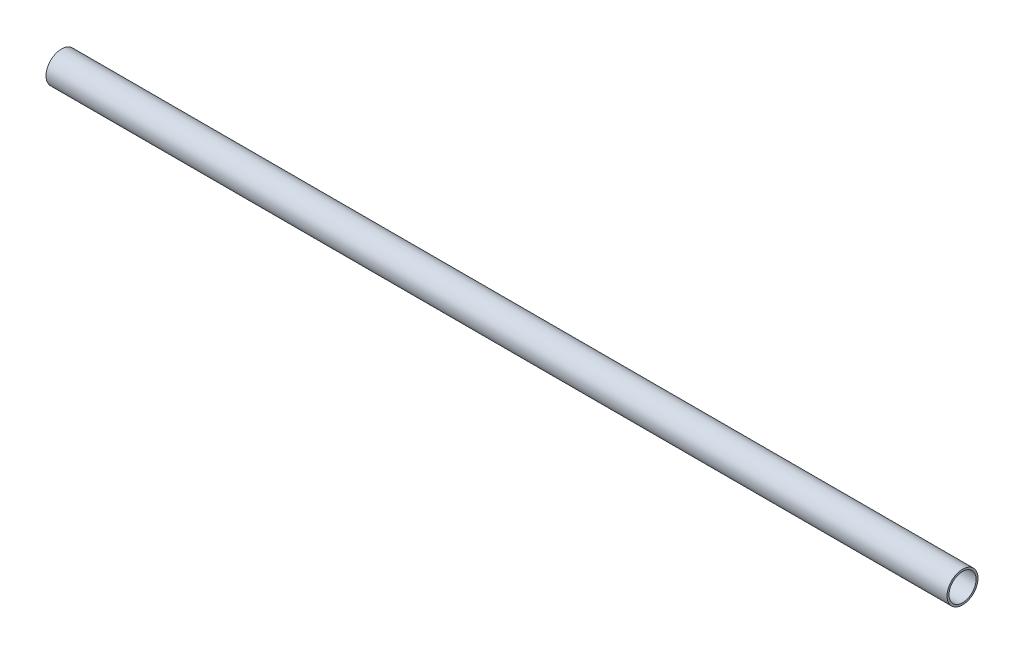
ISO-10303-21;
HEADER;
FILE_DESCRIPTION(('STEP AP214'),'2;1');
FILE_NAME('part.step','',(''),(''),'','','');
FILE_SCHEMA(('AUTOMOTIVE_DESIGN { 1 0 10303 214 1 1 1 1 }'));
ENDSEC;
DATA;
#1=APPLICATION_CONTEXT('core data for automotive mechanical design processes');
#2=APPLICATION_PROTOCOL_DEFINITION('international standard','automotive_design',2000,#1);
#3=PRODUCT_CONTEXT('',#1,'mechanical');
#4=PRODUCT('Part','Part','',(#3));
#5=PRODUCT_RELATED_PRODUCT_CATEGORY('part','',(#4));
#6=PRODUCT_DEFINITION_FORMATION('','',#4);
#7=PRODUCT_DEFINITION_CONTEXT('part definition',#1,'design');
#8=PRODUCT_DEFINITION('design','',#6,#7);
#9=PRODUCT_DEFINITION_SHAPE('','',#8);
#10=(LENGTH_UNIT() NAMED_UNIT(*) SI_UNIT(.MILLI.,.METRE.));
#11=(NAMED_UNIT(*) PLANE_ANGLE_UNIT() SI_UNIT($,.RADIAN.));
#12=(NAMED_UNIT(*) SI_UNIT($,.STERADIAN.) SOLID_ANGLE_UNIT());
#13=UNCERTAINTY_MEASURE_WITH_UNIT(LENGTH_MEASURE(1.E-05),#10,'distance_accuracy_value','');
#14=(GEOMETRIC_REPRESENTATION_CONTEXT(3) GLOBAL_UNCERTAINTY_ASSIGNED_CONTEXT((#13)) GLOBAL_UNIT_ASSIGNED_CONTEXT((#10,
#11,#12)) REPRESENTATION_CONTEXT('',''));
#15=CARTESIAN_POINT('',(0.,0.,0.));
#16=DIRECTION('',(0.,0.,1.));
#17=DIRECTION('',(1.,0.,0.));
#18=AXIS2_PLACEMENT_3D('',#15,#16,#17);
#19=CARTESIAN_POINT('',(0.,8.32499999999993,0.));
#20=DIRECTION('',(1.,0.,0.));
#21=DIRECTION('',(0.,0.,-1.));
#22=AXIS2_PLACEMENT_3D('',#19,#20,#21);
#23=PLANE('',#22);
#24=DIRECTION('',(0.,0.,-1.));
#25=VECTOR('',#24,1.);
#26=CARTESIAN_POINT('',(0.,0.30193155418301,-8.6873868839672));
#27=LINE('',#26,#25);
#28=CARTESIAN_POINT('',(0.,0.30193155418301,-6.6873868839672));
#29=VERTEX_POINT('',#28);
#30=CARTESIAN_POINT('',(0.,0.301931554183009,-8.31952296328266));
#31=VERTEX_POINT('',#30);
#32=EDGE_CURVE('E87',#29,#31,#27,.T.);
#33=ORIENTED_EDGE('',*,*,#32,.T.);
#34=CARTESIAN_POINT('',(0.,0.,0.));
#35=DIRECTION('',(-1.,0.,0.));
#36=DIRECTION('',(0.,0.,1.));
#37=AXIS2_PLACEMENT_3D('',#34,#35,#36);
#38=CIRCLE('',#37,8.32499999999993);
#39=CARTESIAN_POINT('',(0.,-0.30193155418301,-8.31952296328269));
#40=VERTEX_POINT('',#39);
#41=EDGE_CURVE('E115',#40,#31,#38,.T.);
#42=ORIENTED_EDGE('',*,*,#41,.F.);
#43=DIRECTION('',(0.,0.,1.));
#44=VECTOR('',#43,1.);
#45=CARTESIAN_POINT('',(0.,-0.30193155418301,-8.6873868839672));
#46=LINE('',#45,#44);
#47=CARTESIAN_POINT('',(0.,-0.30193155418301,-6.6873868839672));
#48=VERTEX_POINT('',#47);
#49=EDGE_CURVE('E106',#40,#48,#46,.T.);
#50=ORIENTED_EDGE('',*,*,#49,.T.);
#51=DIRECTION('',(0.,1.,0.));
#52=VECTOR('',#51,1.);
#53=CARTESIAN_POINT('',(0.,-0.30193155418301,-6.6873868839672));
#54=LINE('',#53,#52);
#55=EDGE_CURVE('E94',#48,#29,#54,.T.);
#56=ORIENTED_EDGE('',*,*,#55,.T.);
#57=EDGE_LOOP('',(#33,#42,#50,#56));
#58=FACE_BOUND('',#57,.T.);
#59=CARTESIAN_POINT('',(0.,0.,0.));
#60=DIRECTION('',(-1.,0.,0.));
#61=DIRECTION('',(0.,0.,1.));
#62=AXIS2_PLACEMENT_3D('',#59,#60,#61);
#63=CIRCLE('',#62,9.525);
#64=CARTESIAN_POINT('',(0.,0.,9.525));
#65=VERTEX_POINT('',#64);
#66=EDGE_CURVE('E127',#65,#65,#63,.T.);
#67=ORIENTED_EDGE('',*,*,#66,.T.);
#68=EDGE_LOOP('',(#67));
#69=FACE_BOUND('',#68,.T.);
#70=ADVANCED_FACE('F39',(#58,#69),#23,.F.);
#71=CARTESIAN_POINT('',(0.,0.,0.));
#72=DIRECTION('',(-1.,0.,0.));
#73=DIRECTION('',(0.,0.,1.));
#74=AXIS2_PLACEMENT_3D('',#71,#72,#73);
#75=CYLINDRICAL_SURFACE('',#74,9.525);
#76=ORIENTED_EDGE('',*,*,#66,.F.);
#77=EDGE_LOOP('',(#76));
#78=FACE_BOUND('',#77,.T.);
#79=CARTESIAN_POINT('',(554.,0.,0.));
#80=DIRECTION('',(-1.,0.,0.));
#81=DIRECTION('',(0.,0.,1.));
#82=AXIS2_PLACEMENT_3D('',#79,#80,#81);
#83=CIRCLE('',#82,9.525);
#84=CARTESIAN_POINT('',(554.,0.,9.525));
#85=VERTEX_POINT('',#84);
#86=EDGE_CURVE('E123',#85,#85,#83,.T.);
#87=ORIENTED_EDGE('',*,*,#86,.T.);
#88=EDGE_LOOP('',(#87));
#89=FACE_BOUND('',#88,.T.);
#90=ADVANCED_FACE('F152',(#78,#89),#75,.T.);
#91=CARTESIAN_POINT('',(554.,9.525,0.));
#92=DIRECTION('',(-1.,0.,0.));
#93=DIRECTION('',(0.,0.,1.));
#94=AXIS2_PLACEMENT_3D('',#91,#92,#93);
#95=PLANE('',#94);
#96=ORIENTED_EDGE('',*,*,#86,.F.);
#97=EDGE_LOOP('',(#96));
#98=FACE_BOUND('',#97,.T.);
#99=CARTESIAN_POINT('',(554.,0.,0.));
#100=DIRECTION('',(-1.,0.,0.));
#101=DIRECTION('',(0.,0.,1.));
#102=AXIS2_PLACEMENT_3D('',#99,#100,#101);
#103=CIRCLE('',#102,8.325);
#104=CARTESIAN_POINT('',(554.,0.,8.325));
#105=VERTEX_POINT('',#104);
#106=EDGE_CURVE('E119',#105,#105,#103,.T.);
#107=ORIENTED_EDGE('',*,*,#106,.T.);
#108=EDGE_LOOP('',(#107));
#109=FACE_BOUND('',#108,.T.);
#110=ADVANCED_FACE('F148',(#98,#109),#95,.F.);
#111=CARTESIAN_POINT('',(0.,0.,0.));
#112=DIRECTION('',(-1.,0.,0.));
#113=DIRECTION('',(0.,0.,1.));
#114=AXIS2_PLACEMENT_3D('',#111,#112,#113);
#115=CYLINDRICAL_SURFACE('',#114,8.32499999999996);
#116=ORIENTED_EDGE('',*,*,#41,.T.);
#117=DIRECTION('',(-1.,0.,0.));
#118=VECTOR('',#117,1.);
#119=CARTESIAN_POINT('',(0.,0.30193155418301,-8.31952296328269));
#120=LINE('',#119,#118);
#121=CARTESIAN_POINT('',(10.,0.30193155418301,-8.31952296328269));
#122=VERTEX_POINT('',#121);
#123=EDGE_CURVE('E11',#31,#122,#120,.F.);
#124=ORIENTED_EDGE('',*,*,#123,.T.);
#125=CARTESIAN_POINT('',(10.,0.,0.));
#126=DIRECTION('',(1.,0.,0.));
#127=DIRECTION('',(0.,0.,-1.));
#128=AXIS2_PLACEMENT_3D('',#125,#126,#127);
#129=CIRCLE('',#128,8.32499999999996);
#130=CARTESIAN_POINT('',(10.,-0.30193155418301,-8.31952296328269));
#131=VERTEX_POINT('',#130);
#132=EDGE_CURVE('E53',#122,#131,#129,.F.);
#133=ORIENTED_EDGE('',*,*,#132,.T.);
#134=DIRECTION('',(-1.,0.,0.));
#135=VECTOR('',#134,1.);
#136=CARTESIAN_POINT('',(0.,-0.30193155418301,-8.31952296328269));
#137=LINE('',#136,#135);
#138=EDGE_CURVE('E47',#131,#40,#137,.T.);
#139=ORIENTED_EDGE('',*,*,#138,.T.);
#140=EDGE_LOOP('',(#116,#124,#133,#139));
#141=FACE_BOUND('',#140,.T.);
#142=ORIENTED_EDGE('',*,*,#106,.F.);
#143=EDGE_LOOP('',(#142));
#144=FACE_BOUND('',#143,.T.);
#145=ADVANCED_FACE('F133',(#141,#144),#115,.F.);
#146=CARTESIAN_POINT('',(10.,0.30193155418301,-8.6873868839672));
#147=DIRECTION('',(0.,1.,0.));
#148=DIRECTION('',(0.,0.,1.));
#149=AXIS2_PLACEMENT_3D('',#146,#147,#148);
#150=PLANE('',#149);
#151=ORIENTED_EDGE('',*,*,#123,.F.);
#152=ORIENTED_EDGE('',*,*,#32,.F.);
#153=DIRECTION('',(-1.,0.,0.));
#154=VECTOR('',#153,1.);
#155=CARTESIAN_POINT('',(10.,0.30193155418301,-6.6873868839672));
#156=LINE('',#155,#154);
#157=CARTESIAN_POINT('',(10.,0.30193155418301,-6.6873868839672));
#158=VERTEX_POINT('',#157);
#159=EDGE_CURVE('E96',#158,#29,#156,.T.);
#160=ORIENTED_EDGE('',*,*,#159,.F.);
#161=DIRECTION('',(0.,0.,-1.));
#162=VECTOR('',#161,1.);
#163=CARTESIAN_POINT('',(10.,0.30193155418301,-8.6873868839672));
#164=LINE('',#163,#162);
#165=EDGE_CURVE('E97',#158,#122,#164,.T.);
#166=ORIENTED_EDGE('',*,*,#165,.T.);
#167=EDGE_LOOP('',(#151,#152,#160,#166));
#168=FACE_BOUND('',#167,.T.);
#169=ADVANCED_FACE('F139',(#168),#150,.T.);
#170=CARTESIAN_POINT('',(10.,-0.30193155418301,-8.6873868839672));
#171=DIRECTION('',(0.,-1.,0.));
#172=DIRECTION('',(0.,0.,-1.));
#173=AXIS2_PLACEMENT_3D('',#170,#171,#172);
#174=PLANE('',#173);
#175=ORIENTED_EDGE('',*,*,#138,.F.);
#176=DIRECTION('',(0.,0.,1.));
#177=VECTOR('',#176,1.);
#178=CARTESIAN_POINT('',(10.,-0.30193155418301,-8.6873868839672));
#179=LINE('',#178,#177);
#180=CARTESIAN_POINT('',(10.,-0.30193155418301,-6.6873868839672));
#181=VERTEX_POINT('',#180);
#182=EDGE_CURVE('E77',#131,#181,#179,.T.);
#183=ORIENTED_EDGE('',*,*,#182,.T.);
#184=DIRECTION('',(-1.,0.,0.));
#185=VECTOR('',#184,1.);
#186=CARTESIAN_POINT('',(10.,-0.30193155418301,-6.6873868839672));
#187=LINE('',#186,#185);
#188=EDGE_CURVE('E81',#181,#48,#187,.T.);
#189=ORIENTED_EDGE('',*,*,#188,.T.);
#190=ORIENTED_EDGE('',*,*,#49,.F.);
#191=EDGE_LOOP('',(#175,#183,#189,#190));
#192=FACE_BOUND('',#191,.T.);
#193=ADVANCED_FACE('F79',(#192),#174,.T.);
#194=CARTESIAN_POINT('',(10.,0.,0.));
#195=DIRECTION('',(1.,0.,0.));
#196=DIRECTION('',(0.,0.,-1.));
#197=AXIS2_PLACEMENT_3D('',#194,#195,#196);
#198=PLANE('',#197);
#199=ORIENTED_EDGE('',*,*,#132,.F.);
#200=ORIENTED_EDGE('',*,*,#165,.F.);
#201=DIRECTION('',(0.,1.,0.));
#202=VECTOR('',#201,1.);
#203=CARTESIAN_POINT('',(10.,-0.30193155418301,-6.6873868839672));
#204=LINE('',#203,#202);
#205=EDGE_CURVE('E86',#181,#158,#204,.T.);
#206=ORIENTED_EDGE('',*,*,#205,.F.);
#207=ORIENTED_EDGE('',*,*,#182,.F.);
#208=EDGE_LOOP('',(#199,#200,#206,#207));
#209=FACE_BOUND('',#208,.T.);
#210=ADVANCED_FACE('F99',(#209),#198,.T.);
#211=CARTESIAN_POINT('',(10.,-0.30193155418301,-6.6873868839672));
#212=DIRECTION('',(0.,0.,1.));
#213=DIRECTION('',(1.,0.,0.));
#214=AXIS2_PLACEMENT_3D('',#211,#212,#213);
#215=PLANE('',#214);
#216=ORIENTED_EDGE('',*,*,#55,.F.);
#217=ORIENTED_EDGE('',*,*,#188,.F.);
#218=ORIENTED_EDGE('',*,*,#205,.T.);
#219=ORIENTED_EDGE('',*,*,#159,.T.);
#220=EDGE_LOOP('',(#216,#217,#218,#219));
#221=FACE_BOUND('',#220,.T.);
#222=ADVANCED_FACE('F91',(#221),#215,.T.);
#223=CLOSED_SHELL('',(#70,#90,#110,#145,#169,#193,#210,#222));
#224=MANIFOLD_SOLID_BREP('B2',#223);
#225=ADVANCED_BREP_SHAPE_REPRESENTATION('',(#18,#224),#14);
#226=SHAPE_DEFINITION_REPRESENTATION(#9,#225);
ENDSEC;
END-ISO-10303-21;
